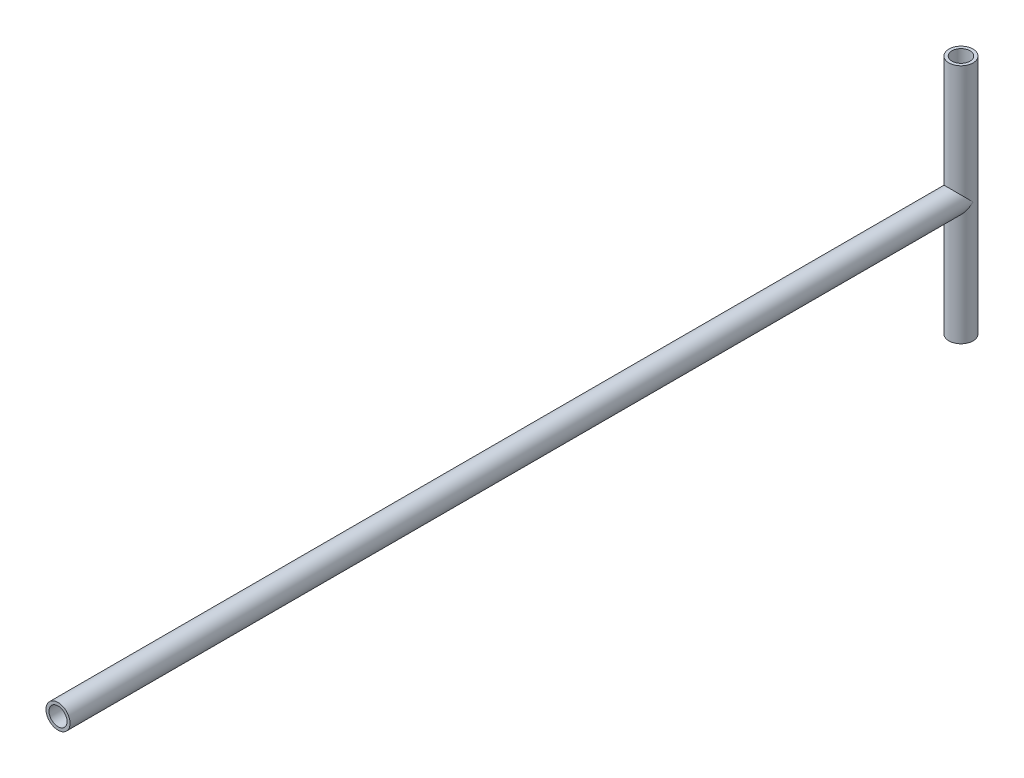
ISO-10303-21;
HEADER;
FILE_DESCRIPTION(('STEP AP214'),'2;1');
FILE_NAME('part.step','',(''),(''),'','','');
FILE_SCHEMA(('AUTOMOTIVE_DESIGN { 1 0 10303 214 1 1 1 1 }'));
ENDSEC;
DATA;
#1=APPLICATION_CONTEXT('core data for automotive mechanical design processes');
#2=APPLICATION_PROTOCOL_DEFINITION('international standard','automotive_design',2000,#1);
#3=PRODUCT_CONTEXT('',#1,'mechanical');
#4=PRODUCT('Part','Part','',(#3));
#5=PRODUCT_RELATED_PRODUCT_CATEGORY('part','',(#4));
#6=PRODUCT_DEFINITION_FORMATION('','',#4);
#7=PRODUCT_DEFINITION_CONTEXT('part definition',#1,'design');
#8=PRODUCT_DEFINITION('design','',#6,#7);
#9=PRODUCT_DEFINITION_SHAPE('','',#8);
#10=(LENGTH_UNIT() NAMED_UNIT(*) SI_UNIT(.MILLI.,.METRE.));
#11=(NAMED_UNIT(*) PLANE_ANGLE_UNIT() SI_UNIT($,.RADIAN.));
#12=(NAMED_UNIT(*) SI_UNIT($,.STERADIAN.) SOLID_ANGLE_UNIT());
#13=UNCERTAINTY_MEASURE_WITH_UNIT(LENGTH_MEASURE(1.E-05),#10,'distance_accuracy_value','');
#14=(GEOMETRIC_REPRESENTATION_CONTEXT(3) GLOBAL_UNCERTAINTY_ASSIGNED_CONTEXT((#13)) GLOBAL_UNIT_ASSIGNED_CONTEXT((#10,
#11,#12)) REPRESENTATION_CONTEXT('',''));
#15=CARTESIAN_POINT('',(0.,0.,0.));
#16=DIRECTION('',(0.,0.,1.));
#17=DIRECTION('',(1.,0.,0.));
#18=AXIS2_PLACEMENT_3D('',#15,#16,#17);
#19=CARTESIAN_POINT('',(0.,0.,300.));
#20=DIRECTION('',(0.,0.,1.));
#21=DIRECTION('',(1.,0.,0.));
#22=AXIS2_PLACEMENT_3D('',#19,#20,#21);
#23=PLANE('',#22);
#24=CARTESIAN_POINT('',(0.,0.,300.));
#25=DIRECTION('',(0.,0.,1.));
#26=DIRECTION('',(1.,0.,0.));
#27=AXIS2_PLACEMENT_3D('',#24,#25,#26);
#28=CIRCLE('',#27,4.);
#29=CARTESIAN_POINT('',(4.,0.,300.));
#30=VERTEX_POINT('',#29);
#31=EDGE_CURVE('E58',#30,#30,#28,.T.);
#32=ORIENTED_EDGE('',*,*,#31,.T.);
#33=EDGE_LOOP('',(#32));
#34=FACE_BOUND('',#33,.T.);
#35=CARTESIAN_POINT('',(0.,0.,300.));
#36=DIRECTION('',(0.,0.,1.));
#37=DIRECTION('',(1.,0.,0.));
#38=AXIS2_PLACEMENT_3D('',#35,#36,#37);
#39=CIRCLE('',#38,3.);
#40=CARTESIAN_POINT('',(3.,0.,300.));
#41=VERTEX_POINT('',#40);
#42=EDGE_CURVE('E71',#41,#41,#39,.T.);
#43=ORIENTED_EDGE('',*,*,#42,.F.);
#44=EDGE_LOOP('',(#43));
#45=FACE_BOUND('',#44,.T.);
#46=ADVANCED_FACE('F45',(#34,#45),#23,.T.);
#47=CARTESIAN_POINT('',(0.,0.,300.));
#48=DIRECTION('',(0.,0.,-1.));
#49=DIRECTION('',(-1.,0.,0.));
#50=AXIS2_PLACEMENT_3D('',#47,#48,#49);
#51=CYLINDRICAL_SURFACE('',#50,4.);
#52=ORIENTED_EDGE('',*,*,#31,.F.);
#53=EDGE_LOOP('',(#52));
#54=FACE_BOUND('',#53,.T.);
#55=CARTESIAN_POINT('',(0.,0.,0.));
#56=DIRECTION('',(0.,-0.707106781186547,-0.707106781186547));
#57=DIRECTION('',(0.,0.707106781186547,-0.707106781186547));
#58=AXIS2_PLACEMENT_3D('',#55,#56,#57);
#59=ELLIPSE('',#58,5.65685424949238,4.);
#60=CARTESIAN_POINT('',(-4.,0.,0.));
#61=VERTEX_POINT('',#60);
#62=CARTESIAN_POINT('',(4.,0.,0.));
#63=VERTEX_POINT('',#62);
#64=EDGE_CURVE('E66',#61,#63,#59,.F.);
#65=ORIENTED_EDGE('',*,*,#64,.T.);
#66=CARTESIAN_POINT('',(0.,0.,0.));
#67=DIRECTION('',(0.,0.707106781186547,-0.707106781186547));
#68=DIRECTION('',(0.,-0.707106781186547,-0.707106781186547));
#69=AXIS2_PLACEMENT_3D('',#66,#67,#68);
#70=ELLIPSE('',#69,5.65685424949238,4.);
#71=EDGE_CURVE('E64',#63,#61,#70,.F.);
#72=ORIENTED_EDGE('',*,*,#71,.T.);
#73=EDGE_LOOP('',(#65,#72));
#74=FACE_BOUND('',#73,.T.);
#75=ADVANCED_FACE('F47',(#54,#74),#51,.T.);
#76=CARTESIAN_POINT('',(0.,0.,300.));
#77=DIRECTION('',(0.,0.,-1.));
#78=DIRECTION('',(-1.,0.,0.));
#79=AXIS2_PLACEMENT_3D('',#76,#77,#78);
#80=CYLINDRICAL_SURFACE('',#79,3.);
#81=CARTESIAN_POINT('',(-3.,0.,2.64575131106459));
#82=CARTESIAN_POINT('',(-3.00000280896557,-0.0700400109545933,2.645745510217));
#83=CARTESIAN_POINT('',(-2.99754094962657,-0.140057631563117,2.64854755685349));
#84=CARTESIAN_POINT('',(-2.98778335234161,-0.279338367039748,2.65954937326353));
#85=CARTESIAN_POINT('',(-2.98048600162194,-0.34860122233532,2.6677509439258));
#86=CARTESIAN_POINT('',(-2.95155901854998,-0.554512621260738,2.69984445943127));
#87=CARTESIAN_POINT('',(-2.92289529116371,-0.689073945480061,2.73122303815329));
#88=CARTESIAN_POINT('',(-2.84967902852603,-0.947198100722392,2.80749414131084));
#89=CARTESIAN_POINT('',(-2.80535116546462,-1.0708870623472,2.85219424245675));
#90=CARTESIAN_POINT('',(-2.70261160960258,-1.30868140121693,2.94973182273596));
#91=CARTESIAN_POINT('',(-2.64420161900243,-1.42278793450775,3.0025683180905));
#92=CARTESIAN_POINT('',(-2.50080271595863,-1.66422514565907,3.12354326851478));
#93=CARTESIAN_POINT('',(-2.41280926238807,-1.78931998588241,3.19256884637289));
#94=CARTESIAN_POINT('',(-2.2186541254275,-2.02506683861348,3.33043252944682));
#95=CARTESIAN_POINT('',(-2.11246568694302,-2.13569715304193,3.3992702047211));
#96=CARTESIAN_POINT('',(-1.92836490190184,-2.30000310928588,3.50539769561968));
#97=CARTESIAN_POINT('',(-1.85597029075026,-2.3588495141595,3.54435965000119));
#98=CARTESIAN_POINT('',(-1.70504181430758,-2.47014549419954,3.6193818859952));
#99=CARTESIAN_POINT('',(-1.62651080993558,-2.52259802147264,3.6554435040806));
#100=CARTESIAN_POINT('',(-1.4637040910827,-2.62041392728754,3.72361957309374));
#101=CARTESIAN_POINT('',(-1.37943756818546,-2.66578828201937,3.75574011862965));
#102=CARTESIAN_POINT('',(-1.20559494807532,-2.74878528245246,3.81509912700353));
#103=CARTESIAN_POINT('',(-1.11602169211667,-2.7864120288213,3.84234017147395));
#104=CARTESIAN_POINT('',(-0.895799479373823,-2.86637910974202,3.90065407398259));
#105=CARTESIAN_POINT('',(-0.762908554560548,-2.9047044787067,3.92898588633408));
#106=CARTESIAN_POINT('',(-0.491088777779694,-2.96278993678961,3.97212104358515));
#107=CARTESIAN_POINT('',(-0.352165281713008,-2.9825661555359,3.98693614179333));
#108=CARTESIAN_POINT('',(-0.0717346069513396,-3.00244085765562,4.00182527262811));
#109=CARTESIAN_POINT('',(0.0697783346711371,-3.00248821011104,4.00186100185061));
#110=CARTESIAN_POINT('',(0.35063349718831,-2.98276482524306,3.9870847294994));
#111=CARTESIAN_POINT('',(0.489975207798217,-2.96298949844351,3.97226928948599));
#112=CARTESIAN_POINT('',(0.757778086122696,-2.90583772087129,3.92982740624245));
#113=CARTESIAN_POINT('',(0.886448455408857,-2.86908729937515,3.90265711426681));
#114=CARTESIAN_POINT('',(1.13536105117422,-2.78000876349667,3.83764561419608));
#115=CARTESIAN_POINT('',(1.25560143283418,-2.72767725241249,3.79980207941239));
#116=CARTESIAN_POINT('',(1.49843381849743,-2.60294075481544,3.71122090691329));
#117=CARTESIAN_POINT('',(1.61987076262548,-2.52897580274822,3.65953080871578));
#118=CARTESIAN_POINT('',(1.84913450790411,-2.36653259607667,3.54921405312389));
#119=CARTESIAN_POINT('',(1.95694957120903,-2.27804197375846,3.49058149661275));
#120=CARTESIAN_POINT('',(2.17816408331313,-2.06955330097201,3.35787531624607));
#121=CARTESIAN_POINT('',(2.28848985950528,-1.94678157961134,3.28303311698989));
#122=CARTESIAN_POINT('',(2.48801751171524,-1.68433083309214,3.13451916601302));
#123=CARTESIAN_POINT('',(2.57720932423716,-1.54464380090688,3.06084798741906));
#124=CARTESIAN_POINT('',(2.71746412822589,-1.27803625954326,2.93638851986388));
#125=CARTESIAN_POINT('',(2.77257733772077,-1.15402590973979,2.88395199558712));
#126=CARTESIAN_POINT('',(2.86638794181777,-0.895869436820914,2.79073482535992));
#127=CARTESIAN_POINT('',(2.90512243472909,-0.7617470392939,2.74992790713867));
#128=CARTESIAN_POINT('',(2.95804770816485,-0.512626113066036,2.69280101182057));
#129=CARTESIAN_POINT('',(2.97558139385094,-0.399105839376982,2.67323078916896));
#130=CARTESIAN_POINT('',(2.99743520848149,-0.169289064046269,2.6487117707326));
#131=CARTESIAN_POINT('',(3.0017722429667,-0.0529963068392496,2.64374426844221));
#132=CARTESIAN_POINT('',(2.99690541681497,0.178957970106777,2.6492573685312));
#133=CARTESIAN_POINT('',(2.98769657209907,0.294619241778161,2.6597436569903));
#134=CARTESIAN_POINT('',(2.95645049123765,0.52215235481211,2.6944244027003));
#135=CARTESIAN_POINT('',(2.93439135868922,0.634017382366583,2.71864225613374));
#136=CARTESIAN_POINT('',(2.86827946945847,0.892675833612172,2.78855502614561));
#137=CARTESIAN_POINT('',(2.81908501412404,1.03687078522466,2.83889586236445));
#138=CARTESIAN_POINT('',(2.70177633577469,1.31261645196258,2.95075783431286));
#139=CARTESIAN_POINT('',(2.63362727745669,1.44414328026578,3.01229948253767));
#140=CARTESIAN_POINT('',(2.47740025533046,1.69869361959232,3.14216325235085));
#141=CARTESIAN_POINT('',(2.38870032302783,1.82124906005961,3.21064858311596));
#142=CARTESIAN_POINT('',(2.19363312764517,2.05202089322889,3.34695922368102));
#143=CARTESIAN_POINT('',(2.08725728128942,2.16023027348304,3.41478419579483));
#144=CARTESIAN_POINT('',(1.90239818691814,2.32153213165692,3.51957077757729));
#145=CARTESIAN_POINT('',(1.82922305125998,2.37965811952592,3.55825033527665));
#146=CARTESIAN_POINT('',(1.67675777822377,2.48943814432249,3.63258399954074));
#147=CARTESIAN_POINT('',(1.5974705382896,2.54109521772846,3.66823952301725));
#148=CARTESIAN_POINT('',(1.4331779554337,2.63724136264881,3.73548722322448));
#149=CARTESIAN_POINT('',(1.3481805396382,2.68174009166812,3.76708486273611));
#150=CARTESIAN_POINT('',(1.17294532822088,2.76288334375196,3.8252747409515));
#151=CARTESIAN_POINT('',(1.0827103944274,2.7995321057078,3.85186968010572));
#152=CARTESIAN_POINT('',(0.861573588365191,2.87683946411381,3.90835673615322));
#153=CARTESIAN_POINT('',(0.72851679290029,2.91350380472521,3.93550115203699));
#154=CARTESIAN_POINT('',(0.456712266621211,2.96826736567963,3.97621371280714));
#155=CARTESIAN_POINT('',(0.317969739628307,2.98638318445571,3.98979399550191));
#156=CARTESIAN_POINT('',(0.038299691845636,3.00303015435829,4.0022690757003));
#157=CARTESIAN_POINT('',(-0.102632185789831,3.00151533129432,4.00112939966075));
#158=CARTESIAN_POINT('',(-0.382019221764038,2.97887872098708,3.98417666975469));
#159=CARTESIAN_POINT('',(-0.520473710285142,2.95775171041909,3.96835970687872));
#160=CARTESIAN_POINT('',(-0.787043562612932,2.89804998722627,3.92406786315679));
#161=CARTESIAN_POINT('',(-0.915342390371117,2.8599995894081,3.89597377375742));
#162=CARTESIAN_POINT('',(-1.16332276886424,2.76842391672118,3.82925445361189));
#163=CARTESIAN_POINT('',(-1.28300246946204,2.71489533167845,3.7906269702888));
#164=CARTESIAN_POINT('',(-1.52509537227955,2.58744411218316,3.70035282969445));
#165=CARTESIAN_POINT('',(-1.64628246914878,2.51189814336095,3.64772704497864));
#166=CARTESIAN_POINT('',(-1.87482962773044,2.34626711280583,3.53571013069578));
#167=CARTESIAN_POINT('',(-1.98217681660196,2.25616868842546,3.47631279811072));
#168=CARTESIAN_POINT('',(-2.2022476229936,2.04398931120081,3.34212703425335));
#169=CARTESIAN_POINT('',(-2.31183387997299,1.91910738721411,3.26661834639247));
#170=CARTESIAN_POINT('',(-2.50950501943596,1.65226367003827,3.11732175300604));
#171=CARTESIAN_POINT('',(-2.59758202428159,1.51029564749764,3.04353448686307));
#172=CARTESIAN_POINT('',(-2.7339195725357,1.24223404800786,2.92099172443149));
#173=CARTESIAN_POINT('',(-2.78667101930056,1.1193318797256,2.87027147723428));
#174=CARTESIAN_POINT('',(-2.87610746935094,0.863832333692755,2.78065231320264));
#175=CARTESIAN_POINT('',(-2.91283513703737,0.73126181213697,2.7417220903151));
#176=CARTESIAN_POINT('',(-2.95994243938014,0.498428371532321,2.69064580071015));
#177=CARTESIAN_POINT('',(-2.97488911938738,0.400081361304639,2.67399401036027));
#178=CARTESIAN_POINT('',(-2.99491264524008,0.201139840614335,2.65155449367015));
#179=CARTESIAN_POINT('',(-2.99999596755294,0.100546848833884,2.64575963854681));
#180=CARTESIAN_POINT('',(-3.,0.,2.64575131106459));
#181=B_SPLINE_CURVE_WITH_KNOTS('',3,(#81,#82,#83,#84,#85,#86,#87,#88,#89,#90,#91,#92,#93,#94,
#95,#96,#97,#98,#99,#100,#101,#102,#103,#104,#105,#106,#107,#108,#109,#110,#111,#112,#113,#114,
#115,#116,#117,#118,#119,#120,#121,#122,#123,#124,#125,#126,#127,#128,#129,#130,#131,#132,#133,
#134,#135,#136,#137,#138,#139,#140,#141,#142,#143,#144,#145,#146,#147,#148,#149,#150,#151,#152,
#153,#154,#155,#156,#157,#158,#159,#160,#161,#162,#163,#164,#165,#166,#167,#168,#169,#170,#171,
#172,#173,#174,#175,#176,#177,#178,#179,#180),.UNSPECIFIED.,.T.,.F.,(4,2,2,2,2,2,2,2,2,2,2,2,2,
2,2,2,2,2,2,2,2,2,2,2,2,2,2,2,2,2,2,2,2,2,2,2,2,2,2,2,2,2,2,2,2,2,2,2,2,4),(0.,
0.209978661686243,0.420027392494301,0.840743284291309,1.2556546103656,1.67051580847001,
2.1722680129487,2.6747644597623,2.97770625271006,3.28050764081971,3.58283470135667,
3.88500133203435,4.30659768868619,4.72782710054931,5.15014819769122,5.57256709596085,
5.98051830103609,6.38855850530847,6.84078006547298,7.29338868088835,7.83503352722912,
8.37693577609375,8.81203137267902,9.2461361153952,9.5942032940531,9.94182439389894,
10.2895734296593,10.6379167570555,11.116643747183,11.5962564359181,12.0929073649363,
12.5898001720674,12.8928465253494,13.1957500925974,13.4982415141315,13.8005691796994,
14.2206053318566,14.6402652787517,15.0609082299889,15.4816632434469,15.8902036618063,
16.2988315155547,16.7537484577603,17.2090855228609,17.7544990195312,18.3001119721387,
18.7279130007848,19.154567923422,19.4562036495329,19.7576412488016),.UNSPECIFIED.);
#182=CARTESIAN_POINT('',(-3.,0.,2.64575131106459));
#183=VERTEX_POINT('',#182);
#184=EDGE_CURVE('E12',#183,#183,#181,.T.);
#185=ORIENTED_EDGE('',*,*,#184,.F.);
#186=EDGE_LOOP('',(#185));
#187=FACE_BOUND('',#186,.T.);
#188=ORIENTED_EDGE('',*,*,#42,.T.);
#189=EDGE_LOOP('',(#188));
#190=FACE_BOUND('',#189,.T.);
#191=ADVANCED_FACE('F82',(#187,#190),#80,.F.);
#192=CARTESIAN_POINT('',(0.,-40.,0.));
#193=DIRECTION('',(0.,1.,0.));
#194=DIRECTION('',(0.,0.,1.));
#195=AXIS2_PLACEMENT_3D('',#192,#193,#194);
#196=CYLINDRICAL_SURFACE('',#195,4.);
#197=ORIENTED_EDGE('',*,*,#184,.T.);
#198=EDGE_LOOP('',(#197));
#199=FACE_BOUND('',#198,.T.);
#200=ADVANCED_FACE('F87',(#199),#196,.T.);
#201=CARTESIAN_POINT('',(0.,40.,0.));
#202=DIRECTION('',(0.,1.,0.));
#203=DIRECTION('',(0.,0.,1.));
#204=AXIS2_PLACEMENT_3D('',#201,#202,#203);
#205=CIRCLE('',#204,4.);
#206=CARTESIAN_POINT('',(0.,40.,4.));
#207=VERTEX_POINT('',#206);
#208=EDGE_CURVE('E112',#207,#207,#205,.T.);
#209=ORIENTED_EDGE('',*,*,#208,.F.);
#210=EDGE_LOOP('',(#209));
#211=FACE_BOUND('',#210,.T.);
#212=CARTESIAN_POINT('',(0.,-40.,0.));
#213=DIRECTION('',(0.,1.,0.));
#214=DIRECTION('',(0.,0.,1.));
#215=AXIS2_PLACEMENT_3D('',#212,#213,#214);
#216=CIRCLE('',#215,4.);
#217=CARTESIAN_POINT('',(0.,-40.,4.));
#218=VERTEX_POINT('',#217);
#219=EDGE_CURVE('E69',#218,#218,#216,.T.);
#220=ORIENTED_EDGE('',*,*,#219,.T.);
#221=EDGE_LOOP('',(#220));
#222=FACE_BOUND('',#221,.T.);
#223=ORIENTED_EDGE('',*,*,#71,.F.);
#224=ORIENTED_EDGE('',*,*,#64,.F.);
#225=EDGE_LOOP('',(#223,#224));
#226=FACE_BOUND('',#225,.T.);
#227=ADVANCED_FACE('F67',(#211,#222,#226),#196,.T.);
#228=CARTESIAN_POINT('',(0.,-40.,0.));
#229=DIRECTION('',(0.,1.,0.));
#230=DIRECTION('',(0.,0.,1.));
#231=AXIS2_PLACEMENT_3D('',#228,#229,#230);
#232=CYLINDRICAL_SURFACE('',#231,3.);
#233=CARTESIAN_POINT('',(0.,-40.,0.));
#234=DIRECTION('',(0.,1.,0.));
#235=DIRECTION('',(0.,0.,1.));
#236=AXIS2_PLACEMENT_3D('',#233,#234,#235);
#237=CIRCLE('',#236,3.);
#238=CARTESIAN_POINT('',(0.,-40.,3.));
#239=VERTEX_POINT('',#238);
#240=EDGE_CURVE('E118',#239,#239,#237,.T.);
#241=ORIENTED_EDGE('',*,*,#240,.F.);
#242=EDGE_LOOP('',(#241));
#243=FACE_BOUND('',#242,.T.);
#244=CARTESIAN_POINT('',(0.,40.,0.));
#245=DIRECTION('',(0.,1.,0.));
#246=DIRECTION('',(0.,0.,1.));
#247=AXIS2_PLACEMENT_3D('',#244,#245,#246);
#248=CIRCLE('',#247,3.);
#249=CARTESIAN_POINT('',(0.,40.,3.));
#250=VERTEX_POINT('',#249);
#251=EDGE_CURVE('E115',#250,#250,#248,.T.);
#252=ORIENTED_EDGE('',*,*,#251,.T.);
#253=EDGE_LOOP('',(#252));
#254=FACE_BOUND('',#253,.T.);
#255=ADVANCED_FACE('F100',(#243,#254),#232,.F.);
#256=CARTESIAN_POINT('',(0.,-40.,0.));
#257=DIRECTION('',(0.,1.,0.));
#258=DIRECTION('',(0.,0.,1.));
#259=AXIS2_PLACEMENT_3D('',#256,#257,#258);
#260=PLANE('',#259);
#261=ORIENTED_EDGE('',*,*,#240,.T.);
#262=EDGE_LOOP('',(#261));
#263=FACE_BOUND('',#262,.T.);
#264=ORIENTED_EDGE('',*,*,#219,.F.);
#265=EDGE_LOOP('',(#264));
#266=FACE_BOUND('',#265,.T.);
#267=ADVANCED_FACE('F96',(#263,#266),#260,.F.);
#268=CARTESIAN_POINT('',(0.,40.,0.));
#269=DIRECTION('',(0.,1.,0.));
#270=DIRECTION('',(0.,0.,1.));
#271=AXIS2_PLACEMENT_3D('',#268,#269,#270);
#272=PLANE('',#271);
#273=ORIENTED_EDGE('',*,*,#208,.T.);
#274=EDGE_LOOP('',(#273));
#275=FACE_BOUND('',#274,.T.);
#276=ORIENTED_EDGE('',*,*,#251,.F.);
#277=EDGE_LOOP('',(#276));
#278=FACE_BOUND('',#277,.T.);
#279=ADVANCED_FACE('F99',(#275,#278),#272,.T.);
#280=CLOSED_SHELL('',(#46,#75,#191,#200,#227,#255,#267,#279));
#281=MANIFOLD_SOLID_BREP('B2',#280);
#282=ADVANCED_BREP_SHAPE_REPRESENTATION('',(#18,#281),#14);
#283=SHAPE_DEFINITION_REPRESENTATION(#9,#282);
ENDSEC;
END-ISO-10303-21;
